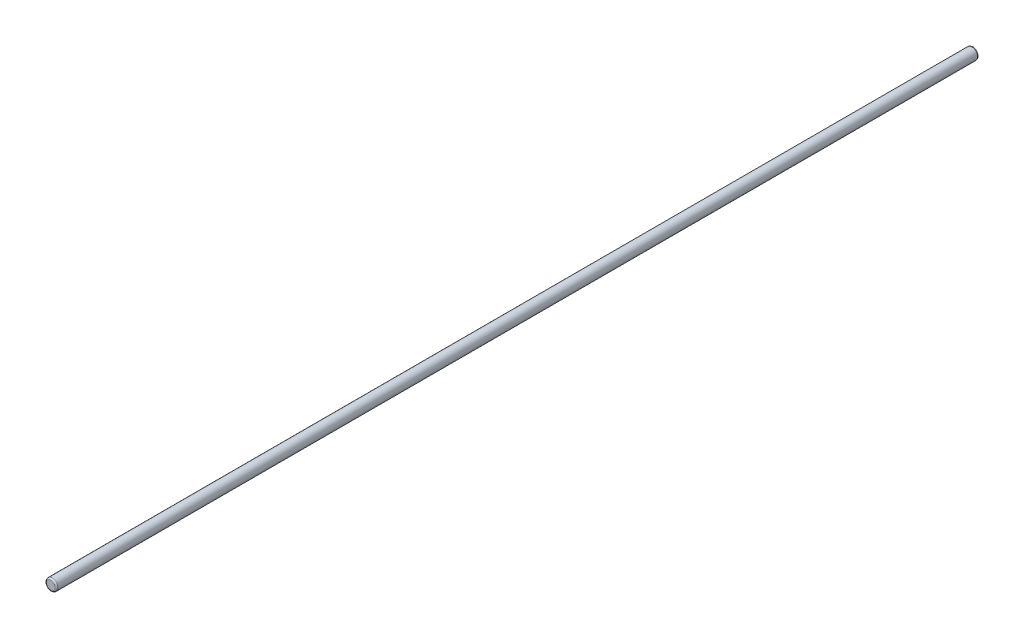
ISO-10303-21;
HEADER;
FILE_DESCRIPTION(('STEP AP214'),'2;1');
FILE_NAME('part.step','',(''),(''),'','','');
FILE_SCHEMA(('AUTOMOTIVE_DESIGN { 1 0 10303 214 1 1 1 1 }'));
ENDSEC;
DATA;
#1=APPLICATION_CONTEXT('core data for automotive mechanical design processes');
#2=APPLICATION_PROTOCOL_DEFINITION('international standard','automotive_design',2000,#1);
#3=PRODUCT_CONTEXT('',#1,'mechanical');
#4=PRODUCT('Part','Part','',(#3));
#5=PRODUCT_RELATED_PRODUCT_CATEGORY('part','',(#4));
#6=PRODUCT_DEFINITION_FORMATION('','',#4);
#7=PRODUCT_DEFINITION_CONTEXT('part definition',#1,'design');
#8=PRODUCT_DEFINITION('design','',#6,#7);
#9=PRODUCT_DEFINITION_SHAPE('','',#8);
#10=(LENGTH_UNIT() NAMED_UNIT(*) SI_UNIT(.MILLI.,.METRE.));
#11=(NAMED_UNIT(*) PLANE_ANGLE_UNIT() SI_UNIT($,.RADIAN.));
#12=(NAMED_UNIT(*) SI_UNIT($,.STERADIAN.) SOLID_ANGLE_UNIT());
#13=UNCERTAINTY_MEASURE_WITH_UNIT(LENGTH_MEASURE(1.E-05),#10,'distance_accuracy_value','');
#14=(GEOMETRIC_REPRESENTATION_CONTEXT(3) GLOBAL_UNCERTAINTY_ASSIGNED_CONTEXT((#13)) GLOBAL_UNIT_ASSIGNED_CONTEXT((#10,
#11,#12)) REPRESENTATION_CONTEXT('',''));
#15=CARTESIAN_POINT('',(0.,0.,0.));
#16=DIRECTION('',(0.,0.,1.));
#17=DIRECTION('',(1.,0.,0.));
#18=AXIS2_PLACEMENT_3D('',#15,#16,#17);
#19=CARTESIAN_POINT('',(0.,0.,-323.625));
#20=DIRECTION('',(0.,0.,1.));
#21=DIRECTION('',(1.,0.,0.));
#22=AXIS2_PLACEMENT_3D('',#19,#20,#21);
#23=CYLINDRICAL_SURFACE('',#22,4.);
#24=CARTESIAN_POINT('',(0.,0.,322.625));
#25=DIRECTION('',(0.,0.,1.));
#26=DIRECTION('',(1.,0.,0.));
#27=AXIS2_PLACEMENT_3D('',#24,#25,#26);
#28=CIRCLE('',#27,4.);
#29=CARTESIAN_POINT('',(4.,0.,322.625));
#30=VERTEX_POINT('',#29);
#31=EDGE_CURVE('E10',#30,#30,#28,.F.);
#32=ORIENTED_EDGE('',*,*,#31,.T.);
#33=EDGE_LOOP('',(#32));
#34=FACE_BOUND('',#33,.T.);
#35=CARTESIAN_POINT('',(0.,0.,-322.625));
#36=DIRECTION('',(0.,0.,1.));
#37=DIRECTION('',(1.,0.,0.));
#38=AXIS2_PLACEMENT_3D('',#35,#36,#37);
#39=CIRCLE('',#38,4.);
#40=CARTESIAN_POINT('',(4.,0.,-322.625));
#41=VERTEX_POINT('',#40);
#42=EDGE_CURVE('E44',#41,#41,#39,.T.);
#43=ORIENTED_EDGE('',*,*,#42,.T.);
#44=EDGE_LOOP('',(#43));
#45=FACE_BOUND('',#44,.T.);
#46=ADVANCED_FACE('F29',(#34,#45),#23,.T.);
#47=CARTESIAN_POINT('',(0.,0.,-323.625));
#48=DIRECTION('',(0.,0.,1.));
#49=DIRECTION('',(1.,0.,0.));
#50=AXIS2_PLACEMENT_3D('',#47,#48,#49);
#51=PLANE('',#50);
#52=CARTESIAN_POINT('',(0.,0.,-323.625));
#53=DIRECTION('',(0.,0.,1.));
#54=DIRECTION('',(1.,0.,0.));
#55=AXIS2_PLACEMENT_3D('',#52,#53,#54);
#56=CIRCLE('',#55,3.);
#57=CARTESIAN_POINT('',(3.,0.,-323.625));
#58=VERTEX_POINT('',#57);
#59=EDGE_CURVE('E40',#58,#58,#56,.F.);
#60=ORIENTED_EDGE('',*,*,#59,.T.);
#61=EDGE_LOOP('',(#60));
#62=FACE_BOUND('',#61,.T.);
#63=ADVANCED_FACE('F60',(#62),#51,.F.);
#64=CARTESIAN_POINT('',(0.,0.,323.625));
#65=DIRECTION('',(0.,0.,1.));
#66=DIRECTION('',(1.,0.,0.));
#67=AXIS2_PLACEMENT_3D('',#64,#65,#66);
#68=PLANE('',#67);
#69=CARTESIAN_POINT('',(0.,0.,323.625));
#70=DIRECTION('',(0.,0.,1.));
#71=DIRECTION('',(1.,0.,0.));
#72=AXIS2_PLACEMENT_3D('',#69,#70,#71);
#73=CIRCLE('',#72,3.);
#74=CARTESIAN_POINT('',(3.,0.,323.625));
#75=VERTEX_POINT('',#74);
#76=EDGE_CURVE('E36',#75,#75,#73,.T.);
#77=ORIENTED_EDGE('',*,*,#76,.T.);
#78=EDGE_LOOP('',(#77));
#79=FACE_BOUND('',#78,.T.);
#80=ADVANCED_FACE('F53',(#79),#68,.T.);
#81=CARTESIAN_POINT('',(0.,0.,-322.625));
#82=DIRECTION('',(0.,0.,1.));
#83=DIRECTION('',(1.,0.,0.));
#84=AXIS2_PLACEMENT_3D('',#81,#82,#83);
#85=TOROIDAL_SURFACE('',#84,3.,1.);
#86=ORIENTED_EDGE('',*,*,#59,.F.);
#87=EDGE_LOOP('',(#86));
#88=FACE_BOUND('',#87,.T.);
#89=ORIENTED_EDGE('',*,*,#42,.F.);
#90=EDGE_LOOP('',(#89));
#91=FACE_BOUND('',#90,.T.);
#92=ADVANCED_FACE('F51',(#88,#91),#85,.T.);
#93=CARTESIAN_POINT('',(0.,0.,322.625));
#94=DIRECTION('',(0.,0.,1.));
#95=DIRECTION('',(1.,0.,0.));
#96=AXIS2_PLACEMENT_3D('',#93,#94,#95);
#97=TOROIDAL_SURFACE('',#96,3.,1.);
#98=ORIENTED_EDGE('',*,*,#31,.F.);
#99=EDGE_LOOP('',(#98));
#100=FACE_BOUND('',#99,.T.);
#101=ORIENTED_EDGE('',*,*,#76,.F.);
#102=EDGE_LOOP('',(#101));
#103=FACE_BOUND('',#102,.T.);
#104=ADVANCED_FACE('F31',(#100,#103),#97,.T.);
#105=CLOSED_SHELL('',(#46,#63,#80,#92,#104));
#106=MANIFOLD_SOLID_BREP('B2',#105);
#107=ADVANCED_BREP_SHAPE_REPRESENTATION('',(#18,#106),#14);
#108=SHAPE_DEFINITION_REPRESENTATION(#9,#107);
ENDSEC;
END-ISO-10303-21;
